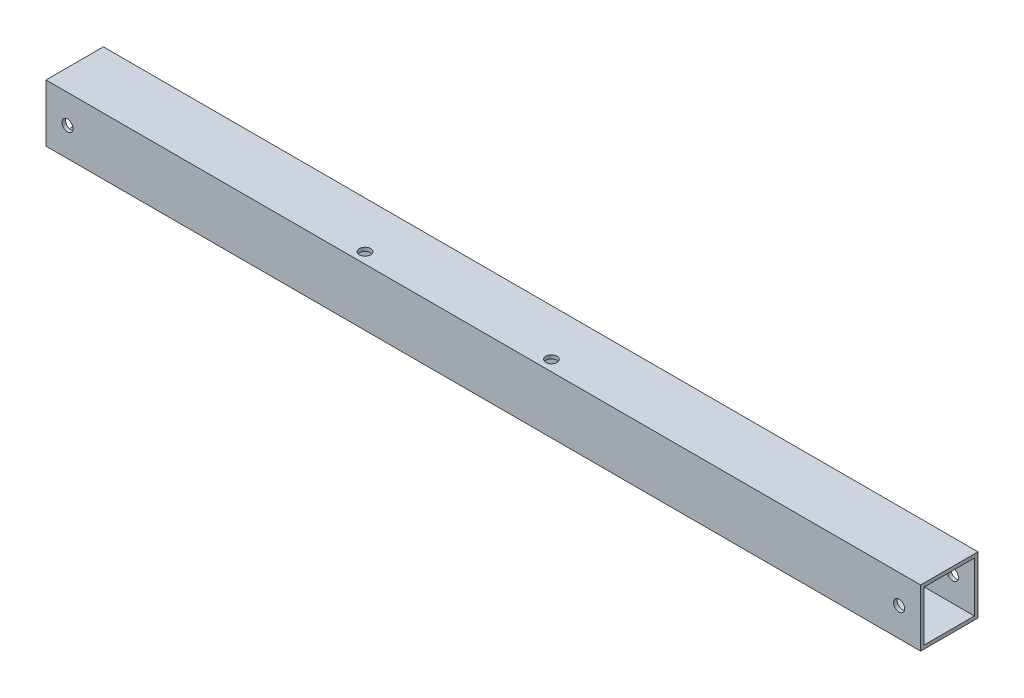
ISO-10303-21;
HEADER;
FILE_DESCRIPTION(('STEP AP214'),'2;1');
FILE_NAME('part.step','',(''),(''),'','','');
FILE_SCHEMA(('AUTOMOTIVE_DESIGN { 1 0 10303 214 1 1 1 1 }'));
ENDSEC;
DATA;
#1=APPLICATION_CONTEXT('core data for automotive mechanical design processes');
#2=APPLICATION_PROTOCOL_DEFINITION('international standard','automotive_design',2000,#1);
#3=PRODUCT_CONTEXT('',#1,'mechanical');
#4=PRODUCT('Part','Part','',(#3));
#5=PRODUCT_RELATED_PRODUCT_CATEGORY('part','',(#4));
#6=PRODUCT_DEFINITION_FORMATION('','',#4);
#7=PRODUCT_DEFINITION_CONTEXT('part definition',#1,'design');
#8=PRODUCT_DEFINITION('design','',#6,#7);
#9=PRODUCT_DEFINITION_SHAPE('','',#8);
#10=(LENGTH_UNIT() NAMED_UNIT(*) SI_UNIT(.MILLI.,.METRE.));
#11=(NAMED_UNIT(*) PLANE_ANGLE_UNIT() SI_UNIT($,.RADIAN.));
#12=(NAMED_UNIT(*) SI_UNIT($,.STERADIAN.) SOLID_ANGLE_UNIT());
#13=UNCERTAINTY_MEASURE_WITH_UNIT(LENGTH_MEASURE(1.E-05),#10,'distance_accuracy_value','');
#14=(GEOMETRIC_REPRESENTATION_CONTEXT(3) GLOBAL_UNCERTAINTY_ASSIGNED_CONTEXT((#13)) GLOBAL_UNIT_ASSIGNED_CONTEXT((#10,
#11,#12)) REPRESENTATION_CONTEXT('',''));
#15=CARTESIAN_POINT('',(0.,0.,0.));
#16=DIRECTION('',(0.,0.,1.));
#17=DIRECTION('',(1.,0.,0.));
#18=AXIS2_PLACEMENT_3D('',#15,#16,#17);
#19=CARTESIAN_POINT('',(387.35,0.,0.));
#20=DIRECTION('',(1.,0.,0.));
#21=DIRECTION('',(0.,0.,-1.));
#22=AXIS2_PLACEMENT_3D('',#19,#20,#21);
#23=PLANE('',#22);
#24=DIRECTION('',(0.,1.,0.));
#25=VECTOR('',#24,1.);
#26=CARTESIAN_POINT('',(387.35,-12.7,-12.7));
#27=LINE('',#26,#25);
#28=CARTESIAN_POINT('',(387.35,-12.7,-12.7));
#29=VERTEX_POINT('',#28);
#30=CARTESIAN_POINT('',(387.35,12.7,-12.7));
#31=VERTEX_POINT('',#30);
#32=EDGE_CURVE('E170',#29,#31,#27,.T.);
#33=ORIENTED_EDGE('',*,*,#32,.T.);
#34=DIRECTION('',(0.,0.,1.));
#35=VECTOR('',#34,1.);
#36=CARTESIAN_POINT('',(387.35,12.7,12.7));
#37=LINE('',#36,#35);
#38=CARTESIAN_POINT('',(387.35,12.7,12.7));
#39=VERTEX_POINT('',#38);
#40=EDGE_CURVE('E173',#31,#39,#37,.T.);
#41=ORIENTED_EDGE('',*,*,#40,.T.);
#42=DIRECTION('',(0.,-1.,0.));
#43=VECTOR('',#42,1.);
#44=CARTESIAN_POINT('',(387.35,-12.7,12.7));
#45=LINE('',#44,#43);
#46=CARTESIAN_POINT('',(387.35,-12.7,12.7));
#47=VERTEX_POINT('',#46);
#48=EDGE_CURVE('E176',#39,#47,#45,.T.);
#49=ORIENTED_EDGE('',*,*,#48,.T.);
#50=DIRECTION('',(0.,0.,-1.));
#51=VECTOR('',#50,1.);
#52=CARTESIAN_POINT('',(387.35,-12.7,12.7));
#53=LINE('',#52,#51);
#54=EDGE_CURVE('E178',#47,#29,#53,.T.);
#55=ORIENTED_EDGE('',*,*,#54,.T.);
#56=EDGE_LOOP('',(#33,#41,#49,#55));
#57=FACE_BOUND('',#56,.T.);
#58=DIRECTION('',(0.,0.,1.));
#59=VECTOR('',#58,1.);
#60=CARTESIAN_POINT('',(387.35,11.1125,0.));
#61=LINE('',#60,#59);
#62=CARTESIAN_POINT('',(387.35,11.1125,-11.1125));
#63=VERTEX_POINT('',#62);
#64=CARTESIAN_POINT('',(387.35,11.1125,11.1125));
#65=VERTEX_POINT('',#64);
#66=EDGE_CURVE('E140',#63,#65,#61,.T.);
#67=ORIENTED_EDGE('',*,*,#66,.F.);
#68=DIRECTION('',(0.,1.,0.));
#69=VECTOR('',#68,1.);
#70=CARTESIAN_POINT('',(387.35,0.,-11.1125));
#71=LINE('',#70,#69);
#72=CARTESIAN_POINT('',(387.35,-11.1125,-11.1125));
#73=VERTEX_POINT('',#72);
#74=EDGE_CURVE('E132',#73,#63,#71,.T.);
#75=ORIENTED_EDGE('',*,*,#74,.F.);
#76=DIRECTION('',(0.,0.,-1.));
#77=VECTOR('',#76,1.);
#78=CARTESIAN_POINT('',(387.35,-11.1125,0.));
#79=LINE('',#78,#77);
#80=CARTESIAN_POINT('',(387.35,-11.1125,11.1125));
#81=VERTEX_POINT('',#80);
#82=EDGE_CURVE('E154',#81,#73,#79,.T.);
#83=ORIENTED_EDGE('',*,*,#82,.F.);
#84=DIRECTION('',(0.,-1.,0.));
#85=VECTOR('',#84,1.);
#86=CARTESIAN_POINT('',(387.35,0.,11.1125));
#87=LINE('',#86,#85);
#88=EDGE_CURVE('E152',#65,#81,#87,.T.);
#89=ORIENTED_EDGE('',*,*,#88,.F.);
#90=EDGE_LOOP('',(#67,#75,#83,#89));
#91=FACE_BOUND('',#90,.T.);
#92=ADVANCED_FACE('F65',(#57,#91),#23,.T.);
#93=CARTESIAN_POINT('',(0.,0.,0.));
#94=DIRECTION('',(1.,0.,0.));
#95=DIRECTION('',(0.,0.,-1.));
#96=AXIS2_PLACEMENT_3D('',#93,#94,#95);
#97=PLANE('',#96);
#98=DIRECTION('',(0.,1.,0.));
#99=VECTOR('',#98,1.);
#100=CARTESIAN_POINT('',(0.,-12.7,-12.7));
#101=LINE('',#100,#99);
#102=CARTESIAN_POINT('',(0.,-12.7,-12.7));
#103=VERTEX_POINT('',#102);
#104=CARTESIAN_POINT('',(0.,12.7,-12.7));
#105=VERTEX_POINT('',#104);
#106=EDGE_CURVE('E148',#103,#105,#101,.T.);
#107=ORIENTED_EDGE('',*,*,#106,.F.);
#108=DIRECTION('',(0.,0.,-1.));
#109=VECTOR('',#108,1.);
#110=CARTESIAN_POINT('',(0.,-12.7,12.7));
#111=LINE('',#110,#109);
#112=CARTESIAN_POINT('',(0.,-12.7,12.7));
#113=VERTEX_POINT('',#112);
#114=EDGE_CURVE('E174',#113,#103,#111,.T.);
#115=ORIENTED_EDGE('',*,*,#114,.F.);
#116=DIRECTION('',(0.,-1.,0.));
#117=VECTOR('',#116,1.);
#118=CARTESIAN_POINT('',(0.,-12.7,12.7));
#119=LINE('',#118,#117);
#120=CARTESIAN_POINT('',(0.,12.7,12.7));
#121=VERTEX_POINT('',#120);
#122=EDGE_CURVE('E185',#121,#113,#119,.T.);
#123=ORIENTED_EDGE('',*,*,#122,.F.);
#124=DIRECTION('',(0.,0.,1.));
#125=VECTOR('',#124,1.);
#126=CARTESIAN_POINT('',(0.,12.7,12.7));
#127=LINE('',#126,#125);
#128=EDGE_CURVE('E183',#105,#121,#127,.T.);
#129=ORIENTED_EDGE('',*,*,#128,.F.);
#130=EDGE_LOOP('',(#107,#115,#123,#129));
#131=FACE_BOUND('',#130,.T.);
#132=DIRECTION('',(0.,1.,0.));
#133=VECTOR('',#132,1.);
#134=CARTESIAN_POINT('',(0.,0.,-11.1125));
#135=LINE('',#134,#133);
#136=CARTESIAN_POINT('',(0.,-11.1125,-11.1125));
#137=VERTEX_POINT('',#136);
#138=CARTESIAN_POINT('',(0.,11.1125,-11.1125));
#139=VERTEX_POINT('',#138);
#140=EDGE_CURVE('E90',#137,#139,#135,.T.);
#141=ORIENTED_EDGE('',*,*,#140,.T.);
#142=DIRECTION('',(0.,0.,1.));
#143=VECTOR('',#142,1.);
#144=CARTESIAN_POINT('',(0.,11.1125,0.));
#145=LINE('',#144,#143);
#146=CARTESIAN_POINT('',(0.,11.1125,11.1125));
#147=VERTEX_POINT('',#146);
#148=EDGE_CURVE('E147',#139,#147,#145,.T.);
#149=ORIENTED_EDGE('',*,*,#148,.T.);
#150=DIRECTION('',(0.,-1.,0.));
#151=VECTOR('',#150,1.);
#152=CARTESIAN_POINT('',(0.,0.,11.1125));
#153=LINE('',#152,#151);
#154=CARTESIAN_POINT('',(0.,-11.1125,11.1125));
#155=VERTEX_POINT('',#154);
#156=EDGE_CURVE('E162',#147,#155,#153,.T.);
#157=ORIENTED_EDGE('',*,*,#156,.T.);
#158=DIRECTION('',(0.,0.,-1.));
#159=VECTOR('',#158,1.);
#160=CARTESIAN_POINT('',(0.,-11.1125,0.));
#161=LINE('',#160,#159);
#162=EDGE_CURVE('E141',#155,#137,#161,.T.);
#163=ORIENTED_EDGE('',*,*,#162,.T.);
#164=EDGE_LOOP('',(#141,#149,#157,#163));
#165=FACE_BOUND('',#164,.T.);
#166=ADVANCED_FACE('F257',(#131,#165),#97,.F.);
#167=CARTESIAN_POINT('',(387.35,-12.7,-12.7));
#168=DIRECTION('',(0.,0.,1.));
#169=DIRECTION('',(1.,0.,0.));
#170=AXIS2_PLACEMENT_3D('',#167,#168,#169);
#171=PLANE('',#170);
#172=CARTESIAN_POINT('',(9.52500000000001,0.,-12.7));
#173=DIRECTION('',(0.,0.,1.));
#174=DIRECTION('',(1.,0.,0.));
#175=AXIS2_PLACEMENT_3D('',#172,#173,#174);
#176=CIRCLE('',#175,2.45744999999999);
#177=CARTESIAN_POINT('',(11.98245,0.,-12.7));
#178=VERTEX_POINT('',#177);
#179=EDGE_CURVE('E202',#178,#178,#176,.T.);
#180=ORIENTED_EDGE('',*,*,#179,.T.);
#181=EDGE_LOOP('',(#180));
#182=FACE_BOUND('',#181,.T.);
#183=CARTESIAN_POINT('',(377.825,0.,-12.7));
#184=DIRECTION('',(0.,0.,1.));
#185=DIRECTION('',(1.,0.,0.));
#186=AXIS2_PLACEMENT_3D('',#183,#184,#185);
#187=CIRCLE('',#186,2.45744999999997);
#188=CARTESIAN_POINT('',(380.28245,0.,-12.7));
#189=VERTEX_POINT('',#188);
#190=EDGE_CURVE('E198',#189,#189,#187,.T.);
#191=ORIENTED_EDGE('',*,*,#190,.T.);
#192=EDGE_LOOP('',(#191));
#193=FACE_BOUND('',#192,.T.);
#194=ORIENTED_EDGE('',*,*,#106,.T.);
#195=DIRECTION('',(-1.,0.,0.));
#196=VECTOR('',#195,1.);
#197=CARTESIAN_POINT('',(387.35,12.7,-12.7));
#198=LINE('',#197,#196);
#199=EDGE_CURVE('E12',#31,#105,#198,.T.);
#200=ORIENTED_EDGE('',*,*,#199,.F.);
#201=ORIENTED_EDGE('',*,*,#32,.F.);
#202=DIRECTION('',(-1.,0.,0.));
#203=VECTOR('',#202,1.);
#204=CARTESIAN_POINT('',(387.35,-12.7,-12.7));
#205=LINE('',#204,#203);
#206=EDGE_CURVE('E180',#29,#103,#205,.T.);
#207=ORIENTED_EDGE('',*,*,#206,.T.);
#208=EDGE_LOOP('',(#194,#200,#201,#207));
#209=FACE_BOUND('',#208,.T.);
#210=ADVANCED_FACE('F67',(#182,#193,#209),#171,.F.);
#211=CARTESIAN_POINT('',(387.35,12.7,12.7));
#212=DIRECTION('',(0.,-1.,0.));
#213=DIRECTION('',(0.,0.,-1.));
#214=AXIS2_PLACEMENT_3D('',#211,#212,#213);
#215=PLANE('',#214);
#216=CARTESIAN_POINT('',(136.525,12.7,7.9375));
#217=DIRECTION('',(0.,1.,0.));
#218=DIRECTION('',(0.,0.,1.));
#219=AXIS2_PLACEMENT_3D('',#216,#217,#218);
#220=CIRCLE('',#219,2.45745);
#221=CARTESIAN_POINT('',(136.525,12.7,10.39495));
#222=VERTEX_POINT('',#221);
#223=EDGE_CURVE('E277',#222,#222,#220,.T.);
#224=ORIENTED_EDGE('',*,*,#223,.F.);
#225=EDGE_LOOP('',(#224));
#226=FACE_BOUND('',#225,.T.);
#227=CARTESIAN_POINT('',(219.075,12.7,7.9375));
#228=DIRECTION('',(0.,1.,0.));
#229=DIRECTION('',(0.,0.,1.));
#230=AXIS2_PLACEMENT_3D('',#227,#228,#229);
#231=CIRCLE('',#230,2.45745);
#232=CARTESIAN_POINT('',(219.075,12.7,10.39495));
#233=VERTEX_POINT('',#232);
#234=EDGE_CURVE('E213',#233,#233,#231,.T.);
#235=ORIENTED_EDGE('',*,*,#234,.F.);
#236=EDGE_LOOP('',(#235));
#237=FACE_BOUND('',#236,.T.);
#238=ORIENTED_EDGE('',*,*,#128,.T.);
#239=DIRECTION('',(-1.,0.,0.));
#240=VECTOR('',#239,1.);
#241=CARTESIAN_POINT('',(387.35,12.7,12.7));
#242=LINE('',#241,#240);
#243=EDGE_CURVE('E74',#39,#121,#242,.T.);
#244=ORIENTED_EDGE('',*,*,#243,.F.);
#245=ORIENTED_EDGE('',*,*,#40,.F.);
#246=ORIENTED_EDGE('',*,*,#199,.T.);
#247=EDGE_LOOP('',(#238,#244,#245,#246));
#248=FACE_BOUND('',#247,.T.);
#249=ADVANCED_FACE('F265',(#226,#237,#248),#215,.F.);
#250=CARTESIAN_POINT('',(387.35,-12.7,12.7));
#251=DIRECTION('',(0.,0.,-1.));
#252=DIRECTION('',(-1.,0.,0.));
#253=AXIS2_PLACEMENT_3D('',#250,#251,#252);
#254=PLANE('',#253);
#255=CARTESIAN_POINT('',(9.52500000000001,0.,12.7));
#256=DIRECTION('',(0.,0.,1.));
#257=DIRECTION('',(1.,0.,0.));
#258=AXIS2_PLACEMENT_3D('',#255,#256,#257);
#259=CIRCLE('',#258,2.45744999999999);
#260=CARTESIAN_POINT('',(11.98245,0.,12.7));
#261=VERTEX_POINT('',#260);
#262=EDGE_CURVE('E210',#261,#261,#259,.T.);
#263=ORIENTED_EDGE('',*,*,#262,.F.);
#264=EDGE_LOOP('',(#263));
#265=FACE_BOUND('',#264,.T.);
#266=CARTESIAN_POINT('',(377.825,0.,12.7));
#267=DIRECTION('',(0.,0.,1.));
#268=DIRECTION('',(1.,0.,0.));
#269=AXIS2_PLACEMENT_3D('',#266,#267,#268);
#270=CIRCLE('',#269,2.45744999999997);
#271=CARTESIAN_POINT('',(380.28245,0.,12.7));
#272=VERTEX_POINT('',#271);
#273=EDGE_CURVE('E228',#272,#272,#270,.T.);
#274=ORIENTED_EDGE('',*,*,#273,.F.);
#275=EDGE_LOOP('',(#274));
#276=FACE_BOUND('',#275,.T.);
#277=ORIENTED_EDGE('',*,*,#122,.T.);
#278=DIRECTION('',(-1.,0.,0.));
#279=VECTOR('',#278,1.);
#280=CARTESIAN_POINT('',(387.35,-12.7,12.7));
#281=LINE('',#280,#279);
#282=EDGE_CURVE('E190',#47,#113,#281,.T.);
#283=ORIENTED_EDGE('',*,*,#282,.F.);
#284=ORIENTED_EDGE('',*,*,#48,.F.);
#285=ORIENTED_EDGE('',*,*,#243,.T.);
#286=EDGE_LOOP('',(#277,#283,#284,#285));
#287=FACE_BOUND('',#286,.T.);
#288=ADVANCED_FACE('F251',(#265,#276,#287),#254,.F.);
#289=CARTESIAN_POINT('',(387.35,-12.7,12.7));
#290=DIRECTION('',(0.,1.,0.));
#291=DIRECTION('',(0.,0.,1.));
#292=AXIS2_PLACEMENT_3D('',#289,#290,#291);
#293=PLANE('',#292);
#294=CARTESIAN_POINT('',(136.525,-12.7,7.9375));
#295=DIRECTION('',(0.,1.,0.));
#296=DIRECTION('',(0.,0.,1.));
#297=AXIS2_PLACEMENT_3D('',#294,#295,#296);
#298=CIRCLE('',#297,2.45745);
#299=CARTESIAN_POINT('',(136.525,-12.7,10.39495));
#300=VERTEX_POINT('',#299);
#301=EDGE_CURVE('E333',#300,#300,#298,.T.);
#302=ORIENTED_EDGE('',*,*,#301,.T.);
#303=EDGE_LOOP('',(#302));
#304=FACE_BOUND('',#303,.T.);
#305=CARTESIAN_POINT('',(219.075,-12.7,7.9375));
#306=DIRECTION('',(0.,1.,0.));
#307=DIRECTION('',(0.,0.,1.));
#308=AXIS2_PLACEMENT_3D('',#305,#306,#307);
#309=CIRCLE('',#308,2.45745);
#310=CARTESIAN_POINT('',(219.075,-12.7,10.39495));
#311=VERTEX_POINT('',#310);
#312=EDGE_CURVE('E206',#311,#311,#309,.T.);
#313=ORIENTED_EDGE('',*,*,#312,.T.);
#314=EDGE_LOOP('',(#313));
#315=FACE_BOUND('',#314,.T.);
#316=ORIENTED_EDGE('',*,*,#114,.T.);
#317=ORIENTED_EDGE('',*,*,#206,.F.);
#318=ORIENTED_EDGE('',*,*,#54,.F.);
#319=ORIENTED_EDGE('',*,*,#282,.T.);
#320=EDGE_LOOP('',(#316,#317,#318,#319));
#321=FACE_BOUND('',#320,.T.);
#322=ADVANCED_FACE('F239',(#304,#315,#321),#293,.F.);
#323=CARTESIAN_POINT('',(387.35,0.,-11.1125));
#324=DIRECTION('',(0.,0.,1.));
#325=DIRECTION('',(1.,0.,0.));
#326=AXIS2_PLACEMENT_3D('',#323,#324,#325);
#327=PLANE('',#326);
#328=CARTESIAN_POINT('',(9.52500000000001,0.,-11.1125));
#329=DIRECTION('',(0.,0.,1.));
#330=DIRECTION('',(1.,0.,0.));
#331=AXIS2_PLACEMENT_3D('',#328,#329,#330);
#332=CIRCLE('',#331,2.45744999999999);
#333=CARTESIAN_POINT('',(11.98245,0.,-11.1125));
#334=VERTEX_POINT('',#333);
#335=EDGE_CURVE('E199',#334,#334,#332,.T.);
#336=ORIENTED_EDGE('',*,*,#335,.F.);
#337=EDGE_LOOP('',(#336));
#338=FACE_BOUND('',#337,.T.);
#339=CARTESIAN_POINT('',(377.825,0.,-11.1125));
#340=DIRECTION('',(0.,0.,1.));
#341=DIRECTION('',(1.,0.,0.));
#342=AXIS2_PLACEMENT_3D('',#339,#340,#341);
#343=CIRCLE('',#342,2.45744999999997);
#344=CARTESIAN_POINT('',(380.28245,0.,-11.1125));
#345=VERTEX_POINT('',#344);
#346=EDGE_CURVE('E160',#345,#345,#343,.T.);
#347=ORIENTED_EDGE('',*,*,#346,.F.);
#348=EDGE_LOOP('',(#347));
#349=FACE_BOUND('',#348,.T.);
#350=ORIENTED_EDGE('',*,*,#140,.F.);
#351=DIRECTION('',(-1.,0.,0.));
#352=VECTOR('',#351,1.);
#353=CARTESIAN_POINT('',(387.35,-11.1125,-11.1125));
#354=LINE('',#353,#352);
#355=EDGE_CURVE('E136',#73,#137,#354,.T.);
#356=ORIENTED_EDGE('',*,*,#355,.F.);
#357=ORIENTED_EDGE('',*,*,#74,.T.);
#358=DIRECTION('',(-1.,0.,0.));
#359=VECTOR('',#358,1.);
#360=CARTESIAN_POINT('',(387.35,11.1125,-11.1125));
#361=LINE('',#360,#359);
#362=EDGE_CURVE('E135',#63,#139,#361,.T.);
#363=ORIENTED_EDGE('',*,*,#362,.T.);
#364=EDGE_LOOP('',(#350,#356,#357,#363));
#365=FACE_BOUND('',#364,.T.);
#366=ADVANCED_FACE('F134',(#338,#349,#365),#327,.T.);
#367=CARTESIAN_POINT('',(387.35,11.1125,0.));
#368=DIRECTION('',(0.,-1.,0.));
#369=DIRECTION('',(0.,0.,-1.));
#370=AXIS2_PLACEMENT_3D('',#367,#368,#369);
#371=PLANE('',#370);
#372=CARTESIAN_POINT('',(136.525,11.1125,7.9375));
#373=DIRECTION('',(0.,-1.,0.));
#374=DIRECTION('',(0.,0.,-1.));
#375=AXIS2_PLACEMENT_3D('',#372,#373,#374);
#376=CIRCLE('',#375,2.45745);
#377=CARTESIAN_POINT('',(136.525,11.1125,5.48005));
#378=VERTEX_POINT('',#377);
#379=EDGE_CURVE('E218',#378,#378,#376,.T.);
#380=ORIENTED_EDGE('',*,*,#379,.F.);
#381=EDGE_LOOP('',(#380));
#382=FACE_BOUND('',#381,.T.);
#383=CARTESIAN_POINT('',(219.075,11.1125,7.9375));
#384=DIRECTION('',(0.,-1.,0.));
#385=DIRECTION('',(0.,0.,-1.));
#386=AXIS2_PLACEMENT_3D('',#383,#384,#385);
#387=CIRCLE('',#386,2.45745);
#388=CARTESIAN_POINT('',(219.075,11.1125,5.48005));
#389=VERTEX_POINT('',#388);
#390=EDGE_CURVE('E203',#389,#389,#387,.T.);
#391=ORIENTED_EDGE('',*,*,#390,.F.);
#392=EDGE_LOOP('',(#391));
#393=FACE_BOUND('',#392,.T.);
#394=ORIENTED_EDGE('',*,*,#148,.F.);
#395=ORIENTED_EDGE('',*,*,#362,.F.);
#396=ORIENTED_EDGE('',*,*,#66,.T.);
#397=DIRECTION('',(-1.,0.,0.));
#398=VECTOR('',#397,1.);
#399=CARTESIAN_POINT('',(387.35,11.1125,11.1125));
#400=LINE('',#399,#398);
#401=EDGE_CURVE('E149',#65,#147,#400,.T.);
#402=ORIENTED_EDGE('',*,*,#401,.T.);
#403=EDGE_LOOP('',(#394,#395,#396,#402));
#404=FACE_BOUND('',#403,.T.);
#405=ADVANCED_FACE('F144',(#382,#393,#404),#371,.T.);
#406=CARTESIAN_POINT('',(387.35,0.,11.1125));
#407=DIRECTION('',(0.,0.,-1.));
#408=DIRECTION('',(-1.,0.,0.));
#409=AXIS2_PLACEMENT_3D('',#406,#407,#408);
#410=PLANE('',#409);
#411=CARTESIAN_POINT('',(9.52500000000001,0.,11.1125));
#412=DIRECTION('',(0.,0.,-1.));
#413=DIRECTION('',(-1.,0.,0.));
#414=AXIS2_PLACEMENT_3D('',#411,#412,#413);
#415=CIRCLE('',#414,2.45744999999999);
#416=CARTESIAN_POINT('',(7.06755000000001,0.,11.1125));
#417=VERTEX_POINT('',#416);
#418=EDGE_CURVE('E201',#417,#417,#415,.T.);
#419=ORIENTED_EDGE('',*,*,#418,.F.);
#420=EDGE_LOOP('',(#419));
#421=FACE_BOUND('',#420,.T.);
#422=CARTESIAN_POINT('',(377.825,0.,11.1125));
#423=DIRECTION('',(0.,0.,-1.));
#424=DIRECTION('',(-1.,0.,0.));
#425=AXIS2_PLACEMENT_3D('',#422,#423,#424);
#426=CIRCLE('',#425,2.45744999999997);
#427=CARTESIAN_POINT('',(375.36755,0.,11.1125));
#428=VERTEX_POINT('',#427);
#429=EDGE_CURVE('E195',#428,#428,#426,.T.);
#430=ORIENTED_EDGE('',*,*,#429,.F.);
#431=EDGE_LOOP('',(#430));
#432=FACE_BOUND('',#431,.T.);
#433=ORIENTED_EDGE('',*,*,#156,.F.);
#434=ORIENTED_EDGE('',*,*,#401,.F.);
#435=ORIENTED_EDGE('',*,*,#88,.T.);
#436=DIRECTION('',(-1.,0.,0.));
#437=VECTOR('',#436,1.);
#438=CARTESIAN_POINT('',(387.35,-11.1125,11.1125));
#439=LINE('',#438,#437);
#440=EDGE_CURVE('E82',#81,#155,#439,.T.);
#441=ORIENTED_EDGE('',*,*,#440,.T.);
#442=EDGE_LOOP('',(#433,#434,#435,#441));
#443=FACE_BOUND('',#442,.T.);
#444=ADVANCED_FACE('F247',(#421,#432,#443),#410,.T.);
#445=CARTESIAN_POINT('',(387.35,-11.1125,0.));
#446=DIRECTION('',(0.,1.,0.));
#447=DIRECTION('',(0.,0.,1.));
#448=AXIS2_PLACEMENT_3D('',#445,#446,#447);
#449=PLANE('',#448);
#450=CARTESIAN_POINT('',(136.525,-11.1125,7.9375));
#451=DIRECTION('',(0.,1.,0.));
#452=DIRECTION('',(0.,0.,1.));
#453=AXIS2_PLACEMENT_3D('',#450,#451,#452);
#454=CIRCLE('',#453,2.45745);
#455=CARTESIAN_POINT('',(136.525,-11.1125,10.39495));
#456=VERTEX_POINT('',#455);
#457=EDGE_CURVE('E69',#456,#456,#454,.T.);
#458=ORIENTED_EDGE('',*,*,#457,.F.);
#459=EDGE_LOOP('',(#458));
#460=FACE_BOUND('',#459,.T.);
#461=CARTESIAN_POINT('',(219.075,-11.1125,7.9375));
#462=DIRECTION('',(0.,1.,0.));
#463=DIRECTION('',(0.,0.,1.));
#464=AXIS2_PLACEMENT_3D('',#461,#462,#463);
#465=CIRCLE('',#464,2.45745);
#466=CARTESIAN_POINT('',(219.075,-11.1125,10.39495));
#467=VERTEX_POINT('',#466);
#468=EDGE_CURVE('E205',#467,#467,#465,.T.);
#469=ORIENTED_EDGE('',*,*,#468,.F.);
#470=EDGE_LOOP('',(#469));
#471=FACE_BOUND('',#470,.T.);
#472=ORIENTED_EDGE('',*,*,#162,.F.);
#473=ORIENTED_EDGE('',*,*,#440,.F.);
#474=ORIENTED_EDGE('',*,*,#82,.T.);
#475=ORIENTED_EDGE('',*,*,#355,.T.);
#476=EDGE_LOOP('',(#472,#473,#474,#475));
#477=FACE_BOUND('',#476,.T.);
#478=ADVANCED_FACE('F295',(#460,#471,#477),#449,.T.);
#479=CARTESIAN_POINT('',(377.825,0.,12.7));
#480=DIRECTION('',(0.,0.,1.));
#481=DIRECTION('',(1.,0.,0.));
#482=AXIS2_PLACEMENT_3D('',#479,#480,#481);
#483=CYLINDRICAL_SURFACE('',#482,2.45744999999997);
#484=ORIENTED_EDGE('',*,*,#429,.T.);
#485=EDGE_LOOP('',(#484));
#486=FACE_BOUND('',#485,.T.);
#487=ORIENTED_EDGE('',*,*,#273,.T.);
#488=EDGE_LOOP('',(#487));
#489=FACE_BOUND('',#488,.T.);
#490=ADVANCED_FACE('F297',(#486,#489),#483,.F.);
#491=ORIENTED_EDGE('',*,*,#346,.T.);
#492=EDGE_LOOP('',(#491));
#493=FACE_BOUND('',#492,.T.);
#494=ORIENTED_EDGE('',*,*,#190,.F.);
#495=EDGE_LOOP('',(#494));
#496=FACE_BOUND('',#495,.T.);
#497=ADVANCED_FACE('F235',(#493,#496),#483,.F.);
#498=CARTESIAN_POINT('',(9.52500000000001,0.,12.7));
#499=DIRECTION('',(0.,0.,1.));
#500=DIRECTION('',(1.,0.,0.));
#501=AXIS2_PLACEMENT_3D('',#498,#499,#500);
#502=CYLINDRICAL_SURFACE('',#501,2.45744999999999);
#503=ORIENTED_EDGE('',*,*,#335,.T.);
#504=EDGE_LOOP('',(#503));
#505=FACE_BOUND('',#504,.T.);
#506=ORIENTED_EDGE('',*,*,#179,.F.);
#507=EDGE_LOOP('',(#506));
#508=FACE_BOUND('',#507,.T.);
#509=ADVANCED_FACE('F311',(#505,#508),#502,.F.);
#510=ORIENTED_EDGE('',*,*,#418,.T.);
#511=EDGE_LOOP('',(#510));
#512=FACE_BOUND('',#511,.T.);
#513=ORIENTED_EDGE('',*,*,#262,.T.);
#514=EDGE_LOOP('',(#513));
#515=FACE_BOUND('',#514,.T.);
#516=ADVANCED_FACE('F314',(#512,#515),#502,.F.);
#517=CARTESIAN_POINT('',(219.075,12.7,7.9375));
#518=DIRECTION('',(0.,1.,0.));
#519=DIRECTION('',(0.,0.,1.));
#520=AXIS2_PLACEMENT_3D('',#517,#518,#519);
#521=CYLINDRICAL_SURFACE('',#520,2.45745);
#522=ORIENTED_EDGE('',*,*,#390,.T.);
#523=EDGE_LOOP('',(#522));
#524=FACE_BOUND('',#523,.T.);
#525=ORIENTED_EDGE('',*,*,#234,.T.);
#526=EDGE_LOOP('',(#525));
#527=FACE_BOUND('',#526,.T.);
#528=ADVANCED_FACE('F316',(#524,#527),#521,.F.);
#529=ORIENTED_EDGE('',*,*,#468,.T.);
#530=EDGE_LOOP('',(#529));
#531=FACE_BOUND('',#530,.T.);
#532=ORIENTED_EDGE('',*,*,#312,.F.);
#533=EDGE_LOOP('',(#532));
#534=FACE_BOUND('',#533,.T.);
#535=ADVANCED_FACE('F318',(#531,#534),#521,.F.);
#536=CARTESIAN_POINT('',(136.525,12.7,7.9375));
#537=DIRECTION('',(0.,1.,0.));
#538=DIRECTION('',(0.,0.,1.));
#539=AXIS2_PLACEMENT_3D('',#536,#537,#538);
#540=CYLINDRICAL_SURFACE('',#539,2.45745);
#541=ORIENTED_EDGE('',*,*,#457,.T.);
#542=EDGE_LOOP('',(#541));
#543=FACE_BOUND('',#542,.T.);
#544=ORIENTED_EDGE('',*,*,#301,.F.);
#545=EDGE_LOOP('',(#544));
#546=FACE_BOUND('',#545,.T.);
#547=ADVANCED_FACE('F319',(#543,#546),#540,.F.);
#548=ORIENTED_EDGE('',*,*,#379,.T.);
#549=EDGE_LOOP('',(#548));
#550=FACE_BOUND('',#549,.T.);
#551=ORIENTED_EDGE('',*,*,#223,.T.);
#552=EDGE_LOOP('',(#551));
#553=FACE_BOUND('',#552,.T.);
#554=ADVANCED_FACE('F321',(#550,#553),#540,.F.);
#555=CLOSED_SHELL('',(#92,#166,#210,#249,#288,#322,#366,#405,#444,#478,#490,#497,#509,#516,#528,
#535,#547,#554));
#556=MANIFOLD_SOLID_BREP('B2',#555);
#557=ADVANCED_BREP_SHAPE_REPRESENTATION('',(#18,#556),#14);
#558=SHAPE_DEFINITION_REPRESENTATION(#9,#557);
ENDSEC;
END-ISO-10303-21;
